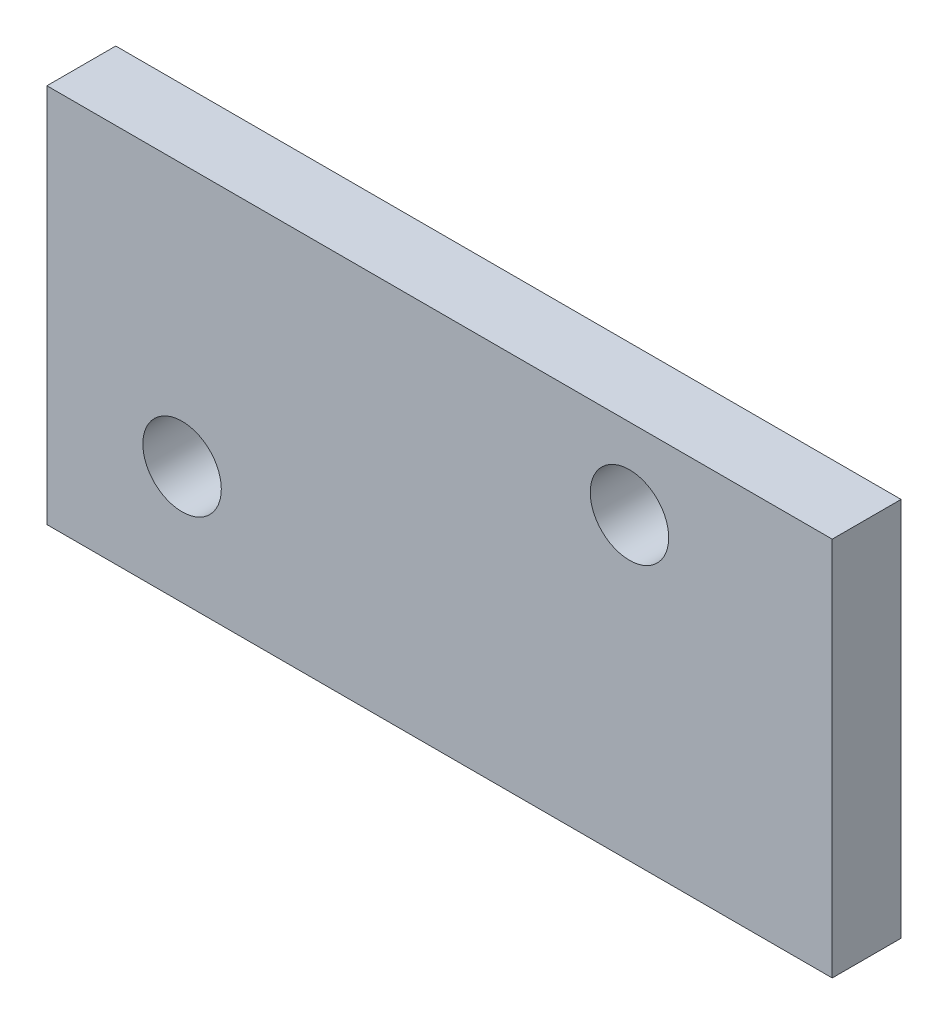
ISO-10303-21;
HEADER;
FILE_DESCRIPTION(('STEP AP214'),'2;1');
FILE_NAME('part.step','',(''),(''),'','','');
FILE_SCHEMA(('AUTOMOTIVE_DESIGN { 1 0 10303 214 1 1 1 1 }'));
ENDSEC;
DATA;
#1=APPLICATION_CONTEXT('core data for automotive mechanical design processes');
#2=APPLICATION_PROTOCOL_DEFINITION('international standard','automotive_design',2000,#1);
#3=PRODUCT_CONTEXT('',#1,'mechanical');
#4=PRODUCT('Part','Part','',(#3));
#5=PRODUCT_RELATED_PRODUCT_CATEGORY('part','',(#4));
#6=PRODUCT_DEFINITION_FORMATION('','',#4);
#7=PRODUCT_DEFINITION_CONTEXT('part definition',#1,'design');
#8=PRODUCT_DEFINITION('design','',#6,#7);
#9=PRODUCT_DEFINITION_SHAPE('','',#8);
#10=(LENGTH_UNIT() NAMED_UNIT(*) SI_UNIT(.MILLI.,.METRE.));
#11=(NAMED_UNIT(*) PLANE_ANGLE_UNIT() SI_UNIT($,.RADIAN.));
#12=(NAMED_UNIT(*) SI_UNIT($,.STERADIAN.) SOLID_ANGLE_UNIT());
#13=UNCERTAINTY_MEASURE_WITH_UNIT(LENGTH_MEASURE(1.E-05),#10,'distance_accuracy_value','');
#14=(GEOMETRIC_REPRESENTATION_CONTEXT(3) GLOBAL_UNCERTAINTY_ASSIGNED_CONTEXT((#13)) GLOBAL_UNIT_ASSIGNED_CONTEXT((#10,
#11,#12)) REPRESENTATION_CONTEXT('',''));
#15=CARTESIAN_POINT('',(0.,0.,0.));
#16=DIRECTION('',(0.,0.,1.));
#17=DIRECTION('',(1.,0.,0.));
#18=AXIS2_PLACEMENT_3D('',#15,#16,#17);
#19=CARTESIAN_POINT('',(0.,0.,2.54));
#20=DIRECTION('',(0.,0.,-1.));
#21=DIRECTION('',(-1.,0.,0.));
#22=AXIS2_PLACEMENT_3D('',#19,#20,#21);
#23=PLANE('',#22);
#24=DIRECTION('',(0.,-1.,0.));
#25=VECTOR('',#24,1.);
#26=CARTESIAN_POINT('',(-205.261185050112,147.36384516268,2.54));
#27=LINE('',#26,#25);
#28=CARTESIAN_POINT('',(-205.261185050112,161.388983356055,2.54));
#29=VERTEX_POINT('',#28);
#30=CARTESIAN_POINT('',(-205.261185050112,147.36384516268,2.54));
#31=VERTEX_POINT('',#30);
#32=EDGE_CURVE('E85',#29,#31,#27,.T.);
#33=ORIENTED_EDGE('',*,*,#32,.T.);
#34=DIRECTION('',(1.,0.,0.));
#35=VECTOR('',#34,1.);
#36=CARTESIAN_POINT('',(-205.261185050112,147.36384516268,2.54));
#37=LINE('',#36,#35);
#38=CARTESIAN_POINT('',(-176.281742034647,147.36384516268,2.54));
#39=VERTEX_POINT('',#38);
#40=EDGE_CURVE('E80',#31,#39,#37,.T.);
#41=ORIENTED_EDGE('',*,*,#40,.T.);
#42=DIRECTION('',(0.,1.,0.));
#43=VECTOR('',#42,1.);
#44=CARTESIAN_POINT('',(-176.281742034647,147.36384516268,2.54));
#45=LINE('',#44,#43);
#46=CARTESIAN_POINT('',(-176.281742034647,161.388983356055,2.54));
#47=VERTEX_POINT('',#46);
#48=EDGE_CURVE('E83',#39,#47,#45,.T.);
#49=ORIENTED_EDGE('',*,*,#48,.T.);
#50=DIRECTION('',(-1.,0.,0.));
#51=VECTOR('',#50,1.);
#52=CARTESIAN_POINT('',(-205.261185050112,161.388983356055,2.54));
#53=LINE('',#52,#51);
#54=EDGE_CURVE('E50',#47,#29,#53,.T.);
#55=ORIENTED_EDGE('',*,*,#54,.T.);
#56=EDGE_LOOP('',(#33,#41,#49,#55));
#57=FACE_BOUND('',#56,.T.);
#58=CARTESIAN_POINT('',(-183.76420186653,158.419196182796,2.54));
#59=DIRECTION('',(0.,0.,1.));
#60=DIRECTION('',(1.,0.,0.));
#61=AXIS2_PLACEMENT_3D('',#58,#59,#60);
#62=CIRCLE('',#61,1.4478);
#63=CARTESIAN_POINT('',(-182.31640186653,158.419196182796,2.54));
#64=VERTEX_POINT('',#63);
#65=EDGE_CURVE('E100',#64,#64,#62,.T.);
#66=ORIENTED_EDGE('',*,*,#65,.F.);
#67=EDGE_LOOP('',(#66));
#68=FACE_BOUND('',#67,.T.);
#69=CARTESIAN_POINT('',(-200.27420186653,151.713596182796,2.54));
#70=DIRECTION('',(0.,0.,1.));
#71=DIRECTION('',(1.,0.,0.));
#72=AXIS2_PLACEMENT_3D('',#69,#70,#71);
#73=CIRCLE('',#72,1.4478);
#74=CARTESIAN_POINT('',(-198.82640186653,151.713596182796,2.54));
#75=VERTEX_POINT('',#74);
#76=EDGE_CURVE('E115',#75,#75,#73,.T.);
#77=ORIENTED_EDGE('',*,*,#76,.F.);
#78=EDGE_LOOP('',(#77));
#79=FACE_BOUND('',#78,.T.);
#80=ADVANCED_FACE('F33',(#57,#68,#79),#23,.F.);
#81=CARTESIAN_POINT('',(0.,0.,0.));
#82=DIRECTION('',(0.,0.,-1.));
#83=DIRECTION('',(-1.,0.,0.));
#84=AXIS2_PLACEMENT_3D('',#81,#82,#83);
#85=PLANE('',#84);
#86=CARTESIAN_POINT('',(-183.76420186653,158.419196182796,0.));
#87=DIRECTION('',(0.,0.,1.));
#88=DIRECTION('',(1.,0.,0.));
#89=AXIS2_PLACEMENT_3D('',#86,#87,#88);
#90=CIRCLE('',#89,1.4478);
#91=CARTESIAN_POINT('',(-182.31640186653,158.419196182796,0.));
#92=VERTEX_POINT('',#91);
#93=EDGE_CURVE('E112',#92,#92,#90,.T.);
#94=ORIENTED_EDGE('',*,*,#93,.T.);
#95=EDGE_LOOP('',(#94));
#96=FACE_BOUND('',#95,.T.);
#97=DIRECTION('',(0.,-1.,0.));
#98=VECTOR('',#97,1.);
#99=CARTESIAN_POINT('',(-205.261185050112,147.36384516268,0.));
#100=LINE('',#99,#98);
#101=CARTESIAN_POINT('',(-205.261185050112,161.388983356055,0.));
#102=VERTEX_POINT('',#101);
#103=CARTESIAN_POINT('',(-205.261185050112,147.36384516268,0.));
#104=VERTEX_POINT('',#103);
#105=EDGE_CURVE('E97',#102,#104,#100,.T.);
#106=ORIENTED_EDGE('',*,*,#105,.F.);
#107=DIRECTION('',(-1.,0.,0.));
#108=VECTOR('',#107,1.);
#109=CARTESIAN_POINT('',(-205.261185050112,161.388983356055,0.));
#110=LINE('',#109,#108);
#111=CARTESIAN_POINT('',(-176.281742034647,161.388983356055,0.));
#112=VERTEX_POINT('',#111);
#113=EDGE_CURVE('E73',#112,#102,#110,.T.);
#114=ORIENTED_EDGE('',*,*,#113,.F.);
#115=DIRECTION('',(0.,1.,0.));
#116=VECTOR('',#115,1.);
#117=CARTESIAN_POINT('',(-176.281742034647,147.36384516268,0.));
#118=LINE('',#117,#116);
#119=CARTESIAN_POINT('',(-176.281742034647,147.36384516268,0.));
#120=VERTEX_POINT('',#119);
#121=EDGE_CURVE('E67',#120,#112,#118,.T.);
#122=ORIENTED_EDGE('',*,*,#121,.F.);
#123=DIRECTION('',(1.,0.,0.));
#124=VECTOR('',#123,1.);
#125=CARTESIAN_POINT('',(-205.261185050112,147.36384516268,0.));
#126=LINE('',#125,#124);
#127=EDGE_CURVE('E89',#104,#120,#126,.T.);
#128=ORIENTED_EDGE('',*,*,#127,.F.);
#129=EDGE_LOOP('',(#106,#114,#122,#128));
#130=FACE_BOUND('',#129,.T.);
#131=CARTESIAN_POINT('',(-200.27420186653,151.713596182796,0.));
#132=DIRECTION('',(0.,0.,1.));
#133=DIRECTION('',(1.,0.,0.));
#134=AXIS2_PLACEMENT_3D('',#131,#132,#133);
#135=CIRCLE('',#134,1.4478);
#136=CARTESIAN_POINT('',(-198.82640186653,151.713596182796,0.));
#137=VERTEX_POINT('',#136);
#138=EDGE_CURVE('E118',#137,#137,#135,.T.);
#139=ORIENTED_EDGE('',*,*,#138,.T.);
#140=EDGE_LOOP('',(#139));
#141=FACE_BOUND('',#140,.T.);
#142=ADVANCED_FACE('F108',(#96,#130,#141),#85,.T.);
#143=CARTESIAN_POINT('',(-205.261185050112,147.36384516268,2.54));
#144=DIRECTION('',(1.,0.,0.));
#145=DIRECTION('',(0.,0.,-1.));
#146=AXIS2_PLACEMENT_3D('',#143,#144,#145);
#147=PLANE('',#146);
#148=ORIENTED_EDGE('',*,*,#105,.T.);
#149=DIRECTION('',(0.,0.,-1.));
#150=VECTOR('',#149,1.);
#151=CARTESIAN_POINT('',(-205.261185050112,147.36384516268,2.54));
#152=LINE('',#151,#150);
#153=EDGE_CURVE('E11',#31,#104,#152,.T.);
#154=ORIENTED_EDGE('',*,*,#153,.F.);
#155=ORIENTED_EDGE('',*,*,#32,.F.);
#156=DIRECTION('',(0.,0.,-1.));
#157=VECTOR('',#156,1.);
#158=CARTESIAN_POINT('',(-205.261185050112,161.388983356055,2.54));
#159=LINE('',#158,#157);
#160=EDGE_CURVE('E93',#29,#102,#159,.T.);
#161=ORIENTED_EDGE('',*,*,#160,.T.);
#162=EDGE_LOOP('',(#148,#154,#155,#161));
#163=FACE_BOUND('',#162,.T.);
#164=ADVANCED_FACE('F35',(#163),#147,.F.);
#165=CARTESIAN_POINT('',(-205.261185050112,147.36384516268,2.54));
#166=DIRECTION('',(0.,1.,0.));
#167=DIRECTION('',(0.,0.,1.));
#168=AXIS2_PLACEMENT_3D('',#165,#166,#167);
#169=PLANE('',#168);
#170=ORIENTED_EDGE('',*,*,#127,.T.);
#171=DIRECTION('',(0.,0.,-1.));
#172=VECTOR('',#171,1.);
#173=CARTESIAN_POINT('',(-176.281742034647,147.36384516268,2.54));
#174=LINE('',#173,#172);
#175=EDGE_CURVE('E42',#39,#120,#174,.T.);
#176=ORIENTED_EDGE('',*,*,#175,.F.);
#177=ORIENTED_EDGE('',*,*,#40,.F.);
#178=ORIENTED_EDGE('',*,*,#153,.T.);
#179=EDGE_LOOP('',(#170,#176,#177,#178));
#180=FACE_BOUND('',#179,.T.);
#181=ADVANCED_FACE('F88',(#180),#169,.F.);
#182=CARTESIAN_POINT('',(-176.281742034647,147.36384516268,2.54));
#183=DIRECTION('',(-1.,0.,0.));
#184=DIRECTION('',(0.,0.,1.));
#185=AXIS2_PLACEMENT_3D('',#182,#183,#184);
#186=PLANE('',#185);
#187=ORIENTED_EDGE('',*,*,#121,.T.);
#188=DIRECTION('',(0.,0.,-1.));
#189=VECTOR('',#188,1.);
#190=CARTESIAN_POINT('',(-176.281742034647,161.388983356055,2.54));
#191=LINE('',#190,#189);
#192=EDGE_CURVE('E90',#47,#112,#191,.T.);
#193=ORIENTED_EDGE('',*,*,#192,.F.);
#194=ORIENTED_EDGE('',*,*,#48,.F.);
#195=ORIENTED_EDGE('',*,*,#175,.T.);
#196=EDGE_LOOP('',(#187,#193,#194,#195));
#197=FACE_BOUND('',#196,.T.);
#198=ADVANCED_FACE('F91',(#197),#186,.F.);
#199=CARTESIAN_POINT('',(-205.261185050112,161.388983356055,2.54));
#200=DIRECTION('',(0.,-1.,0.));
#201=DIRECTION('',(0.,0.,-1.));
#202=AXIS2_PLACEMENT_3D('',#199,#200,#201);
#203=PLANE('',#202);
#204=ORIENTED_EDGE('',*,*,#113,.T.);
#205=ORIENTED_EDGE('',*,*,#160,.F.);
#206=ORIENTED_EDGE('',*,*,#54,.F.);
#207=ORIENTED_EDGE('',*,*,#192,.T.);
#208=EDGE_LOOP('',(#204,#205,#206,#207));
#209=FACE_BOUND('',#208,.T.);
#210=ADVANCED_FACE('F105',(#209),#203,.F.);
#211=CARTESIAN_POINT('',(-183.76420186653,158.419196182796,2.54));
#212=DIRECTION('',(0.,0.,-1.));
#213=DIRECTION('',(-1.,0.,0.));
#214=AXIS2_PLACEMENT_3D('',#211,#212,#213);
#215=CYLINDRICAL_SURFACE('',#214,1.4478);
#216=ORIENTED_EDGE('',*,*,#65,.T.);
#217=EDGE_LOOP('',(#216));
#218=FACE_BOUND('',#217,.T.);
#219=ORIENTED_EDGE('',*,*,#93,.F.);
#220=EDGE_LOOP('',(#219));
#221=FACE_BOUND('',#220,.T.);
#222=ADVANCED_FACE('F135',(#218,#221),#215,.F.);
#223=CARTESIAN_POINT('',(-200.27420186653,151.713596182796,2.54));
#224=DIRECTION('',(0.,0.,-1.));
#225=DIRECTION('',(-1.,0.,0.));
#226=AXIS2_PLACEMENT_3D('',#223,#224,#225);
#227=CYLINDRICAL_SURFACE('',#226,1.4478);
#228=ORIENTED_EDGE('',*,*,#76,.T.);
#229=EDGE_LOOP('',(#228));
#230=FACE_BOUND('',#229,.T.);
#231=ORIENTED_EDGE('',*,*,#138,.F.);
#232=EDGE_LOOP('',(#231));
#233=FACE_BOUND('',#232,.T.);
#234=ADVANCED_FACE('F124',(#230,#233),#227,.F.);
#235=CLOSED_SHELL('',(#80,#142,#164,#181,#198,#210,#222,#234));
#236=MANIFOLD_SOLID_BREP('B2',#235);
#237=ADVANCED_BREP_SHAPE_REPRESENTATION('',(#18,#236),#14);
#238=SHAPE_DEFINITION_REPRESENTATION(#9,#237);
ENDSEC;
END-ISO-10303-21;
